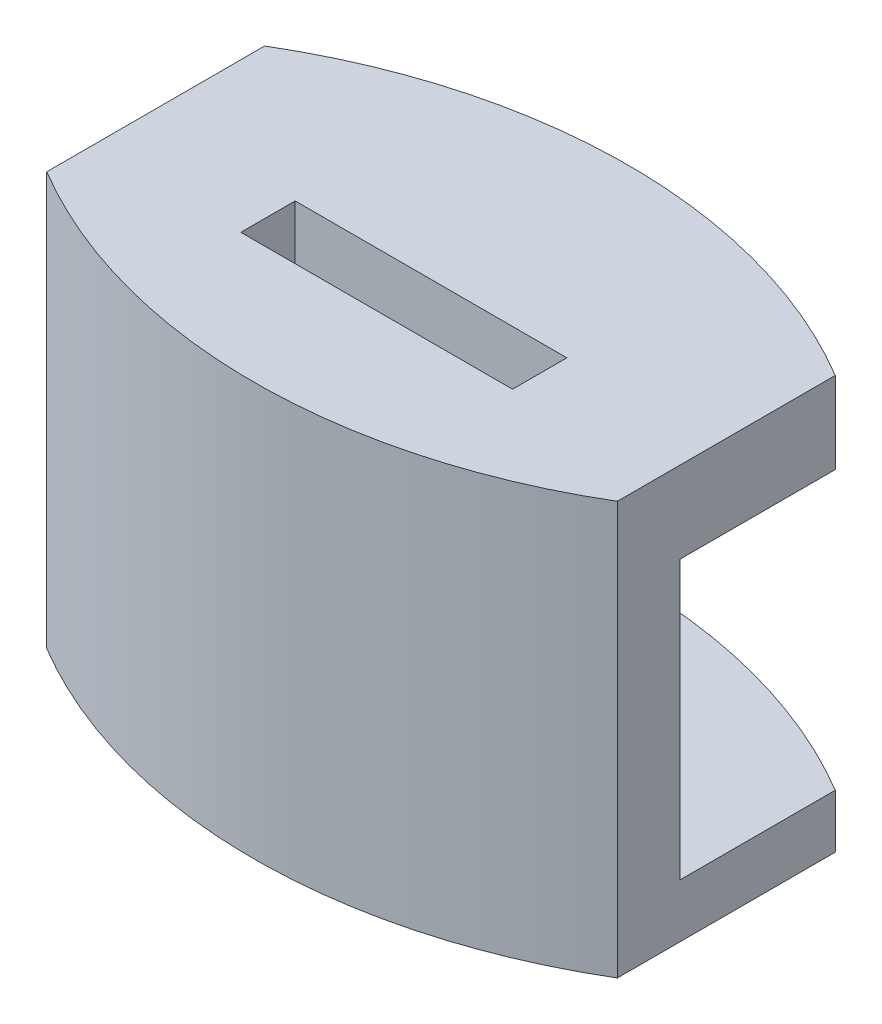
ISO-10303-21;
HEADER;
FILE_DESCRIPTION(('STEP AP214'),'2;1');
FILE_NAME('part.step','',(''),(''),'','','');
FILE_SCHEMA(('AUTOMOTIVE_DESIGN { 1 0 10303 214 1 1 1 1 }'));
ENDSEC;
DATA;
#1=APPLICATION_CONTEXT('core data for automotive mechanical design processes');
#2=APPLICATION_PROTOCOL_DEFINITION('international standard','automotive_design',2000,#1);
#3=PRODUCT_CONTEXT('',#1,'mechanical');
#4=PRODUCT('Part','Part','',(#3));
#5=PRODUCT_RELATED_PRODUCT_CATEGORY('part','',(#4));
#6=PRODUCT_DEFINITION_FORMATION('','',#4);
#7=PRODUCT_DEFINITION_CONTEXT('part definition',#1,'design');
#8=PRODUCT_DEFINITION('design','',#6,#7);
#9=PRODUCT_DEFINITION_SHAPE('','',#8);
#10=(LENGTH_UNIT() NAMED_UNIT(*) SI_UNIT(.MILLI.,.METRE.));
#11=(NAMED_UNIT(*) PLANE_ANGLE_UNIT() SI_UNIT($,.RADIAN.));
#12=(NAMED_UNIT(*) SI_UNIT($,.STERADIAN.) SOLID_ANGLE_UNIT());
#13=UNCERTAINTY_MEASURE_WITH_UNIT(LENGTH_MEASURE(1.E-05),#10,'distance_accuracy_value','');
#14=(GEOMETRIC_REPRESENTATION_CONTEXT(3) GLOBAL_UNCERTAINTY_ASSIGNED_CONTEXT((#13)) GLOBAL_UNIT_ASSIGNED_CONTEXT((#10,
#11,#12)) REPRESENTATION_CONTEXT('',''));
#15=CARTESIAN_POINT('',(0.,0.,0.));
#16=DIRECTION('',(0.,0.,1.));
#17=DIRECTION('',(1.,0.,0.));
#18=AXIS2_PLACEMENT_3D('',#15,#16,#17);
#19=CARTESIAN_POINT('',(0.,0.0119999800000849,8.99521201950843));
#20=DIRECTION('',(0.,1.,0.));
#21=DIRECTION('',(0.,0.,1.));
#22=AXIS2_PLACEMENT_3D('',#19,#20,#21);
#23=CYLINDRICAL_SURFACE('',#22,20.5);
#24=CARTESIAN_POINT('',(0.,2.,8.99521201950843));
#25=DIRECTION('',(0.,-1.,0.));
#26=DIRECTION('',(0.,0.,-1.));
#27=AXIS2_PLACEMENT_3D('',#24,#25,#26);
#28=CIRCLE('',#27,20.5);
#29=CARTESIAN_POINT('',(10.5,2.,-8.61160484215057));
#30=VERTEX_POINT('',#29);
#31=CARTESIAN_POINT('',(-10.5,2.,-8.61160484215058));
#32=VERTEX_POINT('',#31);
#33=EDGE_CURVE('E131',#30,#32,#28,.F.);
#34=ORIENTED_EDGE('',*,*,#33,.F.);
#35=DIRECTION('',(0.,-1.,0.));
#36=VECTOR('',#35,1.);
#37=CARTESIAN_POINT('',(10.5,38.576,-8.61160484215057));
#38=LINE('',#37,#36);
#39=CARTESIAN_POINT('',(10.5,0.0254,-8.61160484215057));
#40=VERTEX_POINT('',#39);
#41=EDGE_CURVE('E171',#30,#40,#38,.T.);
#42=ORIENTED_EDGE('',*,*,#41,.T.);
#43=CARTESIAN_POINT('',(0.,0.0254,8.99521201950843));
#44=DIRECTION('',(0.,1.,0.));
#45=DIRECTION('',(0.,0.,1.));
#46=AXIS2_PLACEMENT_3D('',#43,#44,#45);
#47=CIRCLE('',#46,20.5);
#48=CARTESIAN_POINT('',(-10.5,0.0254,-8.61160484215058));
#49=VERTEX_POINT('',#48);
#50=EDGE_CURVE('E11',#49,#40,#47,.F.);
#51=ORIENTED_EDGE('',*,*,#50,.F.);
#52=DIRECTION('',(0.,1.,0.));
#53=VECTOR('',#52,1.);
#54=CARTESIAN_POINT('',(-10.5,0.0119999800000849,-8.61160484215058));
#55=LINE('',#54,#53);
#56=EDGE_CURVE('E186',#49,#32,#55,.T.);
#57=ORIENTED_EDGE('',*,*,#56,.T.);
#58=EDGE_LOOP('',(#34,#42,#51,#57));
#59=FACE_BOUND('',#58,.T.);
#60=ADVANCED_FACE('F33',(#59),#23,.T.);
#61=CARTESIAN_POINT('',(0.,15.21999998,-20.5));
#62=DIRECTION('',(0.,1.,0.));
#63=DIRECTION('',(0.,0.,1.));
#64=AXIS2_PLACEMENT_3D('',#61,#62,#63);
#65=PLANE('',#64);
#66=DIRECTION('',(0.,0.,-1.));
#67=VECTOR('',#66,1.);
#68=CARTESIAN_POINT('',(4.99999999999999,15.21999998,-20.5));
#69=LINE('',#68,#67);
#70=CARTESIAN_POINT('',(5.,15.21999998,-2.2352));
#71=VERTEX_POINT('',#70);
#72=CARTESIAN_POINT('',(5.,15.21999998,-4.2352));
#73=VERTEX_POINT('',#72);
#74=EDGE_CURVE('E197',#71,#73,#69,.T.);
#75=ORIENTED_EDGE('',*,*,#74,.F.);
#76=DIRECTION('',(1.,0.,0.));
#77=VECTOR('',#76,1.);
#78=CARTESIAN_POINT('',(0.,15.21999998,-2.2352));
#79=LINE('',#78,#77);
#80=CARTESIAN_POINT('',(-5.,15.21999998,-2.2352));
#81=VERTEX_POINT('',#80);
#82=EDGE_CURVE('E204',#81,#71,#79,.T.);
#83=ORIENTED_EDGE('',*,*,#82,.F.);
#84=DIRECTION('',(0.,0.,1.));
#85=VECTOR('',#84,1.);
#86=CARTESIAN_POINT('',(-4.99999999999999,15.21999998,-20.5));
#87=LINE('',#86,#85);
#88=CARTESIAN_POINT('',(-5.,15.21999998,-4.2352));
#89=VERTEX_POINT('',#88);
#90=EDGE_CURVE('E202',#89,#81,#87,.T.);
#91=ORIENTED_EDGE('',*,*,#90,.F.);
#92=DIRECTION('',(-1.,0.,0.));
#93=VECTOR('',#92,1.);
#94=CARTESIAN_POINT('',(0.,15.21999998,-4.2352));
#95=LINE('',#94,#93);
#96=EDGE_CURVE('E198',#73,#89,#95,.T.);
#97=ORIENTED_EDGE('',*,*,#96,.F.);
#98=EDGE_LOOP('',(#75,#83,#91,#97));
#99=FACE_BOUND('',#98,.T.);
#100=CARTESIAN_POINT('',(0.,15.21999998,-18.199999842));
#101=DIRECTION('',(0.,1.,0.));
#102=DIRECTION('',(0.,0.,1.));
#103=AXIS2_PLACEMENT_3D('',#100,#101,#102);
#104=CIRCLE('',#103,20.5);
#105=CARTESIAN_POINT('',(10.5,15.21999998,-0.593182980340997));
#106=VERTEX_POINT('',#105);
#107=CARTESIAN_POINT('',(-10.5,15.21999998,-0.593182980340994));
#108=VERTEX_POINT('',#107);
#109=EDGE_CURVE('E179',#106,#108,#104,.F.);
#110=ORIENTED_EDGE('',*,*,#109,.F.);
#111=DIRECTION('',(0.,0.,-1.));
#112=VECTOR('',#111,1.);
#113=CARTESIAN_POINT('',(10.5,15.21999998,-20.5));
#114=LINE('',#113,#112);
#115=CARTESIAN_POINT('',(10.5,15.21999998,-8.61160484215057));
#116=VERTEX_POINT('',#115);
#117=EDGE_CURVE('E164',#106,#116,#114,.T.);
#118=ORIENTED_EDGE('',*,*,#117,.T.);
#119=CARTESIAN_POINT('',(0.,15.21999998,8.99521201950843));
#120=DIRECTION('',(0.,1.,0.));
#121=DIRECTION('',(0.,0.,-1.));
#122=AXIS2_PLACEMENT_3D('',#119,#120,#121);
#123=CIRCLE('',#122,20.5);
#124=CARTESIAN_POINT('',(-10.5,15.21999998,-8.61160484215058));
#125=VERTEX_POINT('',#124);
#126=EDGE_CURVE('E225',#116,#125,#123,.T.);
#127=ORIENTED_EDGE('',*,*,#126,.T.);
#128=DIRECTION('',(0.,0.,1.));
#129=VECTOR('',#128,1.);
#130=CARTESIAN_POINT('',(-10.5,15.21999998,-20.5));
#131=LINE('',#130,#129);
#132=EDGE_CURVE('E140',#125,#108,#131,.T.);
#133=ORIENTED_EDGE('',*,*,#132,.T.);
#134=EDGE_LOOP('',(#110,#118,#127,#133));
#135=FACE_BOUND('',#134,.T.);
#136=ADVANCED_FACE('F185',(#99,#135),#65,.T.);
#137=CARTESIAN_POINT('',(0.,15.21999998,-20.5));
#138=DIRECTION('',(0.,-1.,0.));
#139=DIRECTION('',(0.,0.,-1.));
#140=AXIS2_PLACEMENT_3D('',#137,#138,#139);
#141=CYLINDRICAL_SURFACE('',#140,20.5);
#142=DIRECTION('',(0.,-1.,0.));
#143=VECTOR('',#142,1.);
#144=CARTESIAN_POINT('',(10.5,15.21999998,-2.893183138341));
#145=LINE('',#144,#143);
#146=CARTESIAN_POINT('',(10.5,2.,-2.893183138341));
#147=VERTEX_POINT('',#146);
#148=CARTESIAN_POINT('',(10.5,12.21999998,-2.893183138341));
#149=VERTEX_POINT('',#148);
#150=EDGE_CURVE('E159',#147,#149,#145,.F.);
#151=ORIENTED_EDGE('',*,*,#150,.F.);
#152=CARTESIAN_POINT('',(0.,2.,-20.5));
#153=DIRECTION('',(0.,1.,0.));
#154=DIRECTION('',(0.,0.,1.));
#155=AXIS2_PLACEMENT_3D('',#152,#153,#154);
#156=CIRCLE('',#155,20.5);
#157=CARTESIAN_POINT('',(-10.5,2.,-2.89318313834099));
#158=VERTEX_POINT('',#157);
#159=EDGE_CURVE('E167',#147,#158,#156,.F.);
#160=ORIENTED_EDGE('',*,*,#159,.T.);
#161=DIRECTION('',(0.,-1.,0.));
#162=VECTOR('',#161,1.);
#163=CARTESIAN_POINT('',(-10.5,15.21999998,-2.89318313834099));
#164=LINE('',#163,#162);
#165=CARTESIAN_POINT('',(-10.5,12.21999998,-2.89318313834099));
#166=VERTEX_POINT('',#165);
#167=EDGE_CURVE('E149',#166,#158,#164,.T.);
#168=ORIENTED_EDGE('',*,*,#167,.F.);
#169=CARTESIAN_POINT('',(0.,12.21999998,-20.5));
#170=DIRECTION('',(0.,-1.,0.));
#171=DIRECTION('',(0.,0.,-1.));
#172=AXIS2_PLACEMENT_3D('',#169,#170,#171);
#173=CIRCLE('',#172,20.5);
#174=EDGE_CURVE('E148',#166,#149,#173,.F.);
#175=ORIENTED_EDGE('',*,*,#174,.T.);
#176=EDGE_LOOP('',(#151,#160,#168,#175));
#177=FACE_BOUND('',#176,.T.);
#178=ADVANCED_FACE('F35',(#177),#141,.F.);
#179=CARTESIAN_POINT('',(0.,12.21999998,0.));
#180=DIRECTION('',(0.,-1.,0.));
#181=DIRECTION('',(0.,0.,-1.));
#182=AXIS2_PLACEMENT_3D('',#179,#180,#181);
#183=PLANE('',#182);
#184=DIRECTION('',(0.,0.,-1.));
#185=VECTOR('',#184,1.);
#186=CARTESIAN_POINT('',(-10.5,12.21999998,0.));
#187=LINE('',#186,#185);
#188=CARTESIAN_POINT('',(-10.5,12.21999998,-8.61160484215057));
#189=VERTEX_POINT('',#188);
#190=EDGE_CURVE('E136',#166,#189,#187,.T.);
#191=ORIENTED_EDGE('',*,*,#190,.T.);
#192=CARTESIAN_POINT('',(0.,12.21999998,8.99521201950843));
#193=DIRECTION('',(0.,1.,0.));
#194=DIRECTION('',(0.,0.,1.));
#195=AXIS2_PLACEMENT_3D('',#192,#193,#194);
#196=CIRCLE('',#195,20.5);
#197=CARTESIAN_POINT('',(10.5,12.21999998,-8.61160484215057));
#198=VERTEX_POINT('',#197);
#199=EDGE_CURVE('E121',#189,#198,#196,.F.);
#200=ORIENTED_EDGE('',*,*,#199,.T.);
#201=DIRECTION('',(0.,0.,1.));
#202=VECTOR('',#201,1.);
#203=CARTESIAN_POINT('',(10.5,12.21999998,0.));
#204=LINE('',#203,#202);
#205=EDGE_CURVE('E162',#198,#149,#204,.T.);
#206=ORIENTED_EDGE('',*,*,#205,.T.);
#207=ORIENTED_EDGE('',*,*,#174,.F.);
#208=EDGE_LOOP('',(#191,#200,#206,#207));
#209=FACE_BOUND('',#208,.T.);
#210=DIRECTION('',(0.,0.,1.));
#211=VECTOR('',#210,1.);
#212=CARTESIAN_POINT('',(5.,12.21999998,-2.2352));
#213=LINE('',#212,#211);
#214=CARTESIAN_POINT('',(5.,12.21999998,-4.2352));
#215=VERTEX_POINT('',#214);
#216=CARTESIAN_POINT('',(5.,12.21999998,-2.2352));
#217=VERTEX_POINT('',#216);
#218=EDGE_CURVE('E141',#215,#217,#213,.T.);
#219=ORIENTED_EDGE('',*,*,#218,.F.);
#220=DIRECTION('',(1.,0.,0.));
#221=VECTOR('',#220,1.);
#222=CARTESIAN_POINT('',(-5.,12.21999998,-4.2352));
#223=LINE('',#222,#221);
#224=CARTESIAN_POINT('',(-5.,12.21999998,-4.2352));
#225=VERTEX_POINT('',#224);
#226=EDGE_CURVE('E210',#225,#215,#223,.T.);
#227=ORIENTED_EDGE('',*,*,#226,.F.);
#228=DIRECTION('',(0.,0.,-1.));
#229=VECTOR('',#228,1.);
#230=CARTESIAN_POINT('',(-5.,12.21999998,-2.2352));
#231=LINE('',#230,#229);
#232=CARTESIAN_POINT('',(-5.,12.21999998,-2.2352));
#233=VERTEX_POINT('',#232);
#234=EDGE_CURVE('E217',#233,#225,#231,.T.);
#235=ORIENTED_EDGE('',*,*,#234,.F.);
#236=DIRECTION('',(-1.,0.,0.));
#237=VECTOR('',#236,1.);
#238=CARTESIAN_POINT('',(-5.,12.21999998,-2.2352));
#239=LINE('',#238,#237);
#240=EDGE_CURVE('E220',#217,#233,#239,.T.);
#241=ORIENTED_EDGE('',*,*,#240,.F.);
#242=EDGE_LOOP('',(#219,#227,#235,#241));
#243=FACE_BOUND('',#242,.T.);
#244=ADVANCED_FACE('F145',(#209,#243),#183,.T.);
#245=CARTESIAN_POINT('',(0.,2.,0.));
#246=DIRECTION('',(0.,1.,0.));
#247=DIRECTION('',(0.,0.,1.));
#248=AXIS2_PLACEMENT_3D('',#245,#246,#247);
#249=PLANE('',#248);
#250=DIRECTION('',(0.,0.,-1.));
#251=VECTOR('',#250,1.);
#252=CARTESIAN_POINT('',(10.5,2.,0.));
#253=LINE('',#252,#251);
#254=EDGE_CURVE('E151',#147,#30,#253,.T.);
#255=ORIENTED_EDGE('',*,*,#254,.T.);
#256=ORIENTED_EDGE('',*,*,#33,.T.);
#257=DIRECTION('',(0.,0.,1.));
#258=VECTOR('',#257,1.);
#259=CARTESIAN_POINT('',(-10.5,2.,0.));
#260=LINE('',#259,#258);
#261=EDGE_CURVE('E153',#32,#158,#260,.T.);
#262=ORIENTED_EDGE('',*,*,#261,.T.);
#263=ORIENTED_EDGE('',*,*,#159,.F.);
#264=EDGE_LOOP('',(#255,#256,#262,#263));
#265=FACE_BOUND('',#264,.T.);
#266=ADVANCED_FACE('F231',(#265),#249,.T.);
#267=CARTESIAN_POINT('',(-10.5,38.576,52.2585437792315));
#268=DIRECTION('',(-1.,0.,0.));
#269=DIRECTION('',(0.,0.,1.));
#270=AXIS2_PLACEMENT_3D('',#267,#268,#269);
#271=PLANE('',#270);
#272=DIRECTION('',(0.,0.,-1.));
#273=VECTOR('',#272,1.);
#274=CARTESIAN_POINT('',(-10.5,0.0254000000000018,52.2585437792315));
#275=LINE('',#274,#273);
#276=CARTESIAN_POINT('',(-10.5,0.0254000000000018,-0.59318298034098));
#277=VERTEX_POINT('',#276);
#278=EDGE_CURVE('E47',#277,#49,#275,.T.);
#279=ORIENTED_EDGE('',*,*,#278,.F.);
#280=DIRECTION('',(0.,-1.,0.));
#281=VECTOR('',#280,1.);
#282=CARTESIAN_POINT('',(-10.5,29.69799998,-0.593182980340994));
#283=LINE('',#282,#281);
#284=EDGE_CURVE('E142',#108,#277,#283,.T.);
#285=ORIENTED_EDGE('',*,*,#284,.F.);
#286=ORIENTED_EDGE('',*,*,#132,.F.);
#287=DIRECTION('',(0.,1.,0.));
#288=VECTOR('',#287,1.);
#289=CARTESIAN_POINT('',(-10.5,38.576,-8.61160484215057));
#290=LINE('',#289,#288);
#291=EDGE_CURVE('E125',#189,#125,#290,.T.);
#292=ORIENTED_EDGE('',*,*,#291,.F.);
#293=ORIENTED_EDGE('',*,*,#190,.F.);
#294=ORIENTED_EDGE('',*,*,#167,.T.);
#295=ORIENTED_EDGE('',*,*,#261,.F.);
#296=ORIENTED_EDGE('',*,*,#56,.F.);
#297=EDGE_LOOP('',(#279,#285,#286,#292,#293,#294,#295,#296));
#298=FACE_BOUND('',#297,.T.);
#299=ADVANCED_FACE('F134',(#298),#271,.T.);
#300=CARTESIAN_POINT('',(10.5,38.576,52.2585437792315));
#301=DIRECTION('',(1.,0.,0.));
#302=DIRECTION('',(0.,0.,-1.));
#303=AXIS2_PLACEMENT_3D('',#300,#301,#302);
#304=PLANE('',#303);
#305=DIRECTION('',(0.,0.,1.));
#306=VECTOR('',#305,1.);
#307=CARTESIAN_POINT('',(10.5,0.0254000000000018,52.2585437792315));
#308=LINE('',#307,#306);
#309=CARTESIAN_POINT('',(10.5,0.0254000000000018,-0.59318298034098));
#310=VERTEX_POINT('',#309);
#311=EDGE_CURVE('E229',#40,#310,#308,.T.);
#312=ORIENTED_EDGE('',*,*,#311,.F.);
#313=ORIENTED_EDGE('',*,*,#41,.F.);
#314=ORIENTED_EDGE('',*,*,#254,.F.);
#315=ORIENTED_EDGE('',*,*,#150,.T.);
#316=ORIENTED_EDGE('',*,*,#205,.F.);
#317=EDGE_CURVE('E127',#116,#198,#38,.T.);
#318=ORIENTED_EDGE('',*,*,#317,.F.);
#319=ORIENTED_EDGE('',*,*,#117,.F.);
#320=DIRECTION('',(0.,-1.,0.));
#321=VECTOR('',#320,1.);
#322=CARTESIAN_POINT('',(10.5,29.69799998,-0.593182980340997));
#323=LINE('',#322,#321);
#324=EDGE_CURVE('E41',#310,#106,#323,.F.);
#325=ORIENTED_EDGE('',*,*,#324,.F.);
#326=EDGE_LOOP('',(#312,#313,#314,#315,#316,#318,#319,#325));
#327=FACE_BOUND('',#326,.T.);
#328=ADVANCED_FACE('F188',(#327),#304,.T.);
#329=CARTESIAN_POINT('',(5.,50.79599998,-2.2352));
#330=DIRECTION('',(1.,0.,0.));
#331=DIRECTION('',(0.,0.,-1.));
#332=AXIS2_PLACEMENT_3D('',#329,#330,#331);
#333=PLANE('',#332);
#334=ORIENTED_EDGE('',*,*,#74,.T.);
#335=DIRECTION('',(0.,-1.,0.));
#336=VECTOR('',#335,1.);
#337=CARTESIAN_POINT('',(5.,50.79599998,-4.2352));
#338=LINE('',#337,#336);
#339=EDGE_CURVE('E206',#73,#215,#338,.T.);
#340=ORIENTED_EDGE('',*,*,#339,.T.);
#341=ORIENTED_EDGE('',*,*,#218,.T.);
#342=DIRECTION('',(0.,-1.,0.));
#343=VECTOR('',#342,1.);
#344=CARTESIAN_POINT('',(5.,50.79599998,-2.2352));
#345=LINE('',#344,#343);
#346=EDGE_CURVE('E207',#71,#217,#345,.T.);
#347=ORIENTED_EDGE('',*,*,#346,.F.);
#348=EDGE_LOOP('',(#334,#340,#341,#347));
#349=FACE_BOUND('',#348,.T.);
#350=ADVANCED_FACE('F253',(#349),#333,.F.);
#351=CARTESIAN_POINT('',(-5.,50.79599998,-4.2352));
#352=DIRECTION('',(0.,0.,-1.));
#353=DIRECTION('',(-1.,0.,0.));
#354=AXIS2_PLACEMENT_3D('',#351,#352,#353);
#355=PLANE('',#354);
#356=ORIENTED_EDGE('',*,*,#96,.T.);
#357=DIRECTION('',(0.,-1.,0.));
#358=VECTOR('',#357,1.);
#359=CARTESIAN_POINT('',(-5.,50.79599998,-4.2352));
#360=LINE('',#359,#358);
#361=EDGE_CURVE('E212',#89,#225,#360,.T.);
#362=ORIENTED_EDGE('',*,*,#361,.T.);
#363=ORIENTED_EDGE('',*,*,#226,.T.);
#364=ORIENTED_EDGE('',*,*,#339,.F.);
#365=EDGE_LOOP('',(#356,#362,#363,#364));
#366=FACE_BOUND('',#365,.T.);
#367=ADVANCED_FACE('F249',(#366),#355,.F.);
#368=CARTESIAN_POINT('',(-5.,50.79599998,-2.2352));
#369=DIRECTION('',(-1.,0.,0.));
#370=DIRECTION('',(0.,0.,1.));
#371=AXIS2_PLACEMENT_3D('',#368,#369,#370);
#372=PLANE('',#371);
#373=ORIENTED_EDGE('',*,*,#90,.T.);
#374=DIRECTION('',(0.,-1.,0.));
#375=VECTOR('',#374,1.);
#376=CARTESIAN_POINT('',(-5.,50.79599998,-2.2352));
#377=LINE('',#376,#375);
#378=EDGE_CURVE('E55',#81,#233,#377,.T.);
#379=ORIENTED_EDGE('',*,*,#378,.T.);
#380=ORIENTED_EDGE('',*,*,#234,.T.);
#381=ORIENTED_EDGE('',*,*,#361,.F.);
#382=EDGE_LOOP('',(#373,#379,#380,#381));
#383=FACE_BOUND('',#382,.T.);
#384=ADVANCED_FACE('F252',(#383),#372,.F.);
#385=CARTESIAN_POINT('',(-5.,50.79599998,-2.2352));
#386=DIRECTION('',(0.,0.,1.));
#387=DIRECTION('',(1.,0.,0.));
#388=AXIS2_PLACEMENT_3D('',#385,#386,#387);
#389=PLANE('',#388);
#390=ORIENTED_EDGE('',*,*,#82,.T.);
#391=ORIENTED_EDGE('',*,*,#346,.T.);
#392=ORIENTED_EDGE('',*,*,#240,.T.);
#393=ORIENTED_EDGE('',*,*,#378,.F.);
#394=EDGE_LOOP('',(#390,#391,#392,#393));
#395=FACE_BOUND('',#394,.T.);
#396=ADVANCED_FACE('F248',(#395),#389,.F.);
#397=CARTESIAN_POINT('',(0.,29.69799998,-18.199999842));
#398=DIRECTION('',(0.,-1.,0.));
#399=DIRECTION('',(0.,0.,-1.));
#400=AXIS2_PLACEMENT_3D('',#397,#398,#399);
#401=CYLINDRICAL_SURFACE('',#400,20.5);
#402=ORIENTED_EDGE('',*,*,#284,.T.);
#403=CARTESIAN_POINT('',(0.,0.0253999999999983,-18.199999842));
#404=DIRECTION('',(0.,1.,0.));
#405=DIRECTION('',(0.,0.,1.));
#406=AXIS2_PLACEMENT_3D('',#403,#404,#405);
#407=CIRCLE('',#406,20.5);
#408=EDGE_CURVE('E180',#277,#310,#407,.T.);
#409=ORIENTED_EDGE('',*,*,#408,.T.);
#410=ORIENTED_EDGE('',*,*,#324,.T.);
#411=ORIENTED_EDGE('',*,*,#109,.T.);
#412=EDGE_LOOP('',(#402,#409,#410,#411));
#413=FACE_BOUND('',#412,.T.);
#414=ADVANCED_FACE('F178',(#413),#401,.T.);
#415=ORIENTED_EDGE('',*,*,#199,.F.);
#416=ORIENTED_EDGE('',*,*,#291,.T.);
#417=ORIENTED_EDGE('',*,*,#126,.F.);
#418=ORIENTED_EDGE('',*,*,#317,.T.);
#419=EDGE_LOOP('',(#415,#416,#417,#418));
#420=FACE_BOUND('',#419,.T.);
#421=ADVANCED_FACE('F123',(#420),#23,.T.);
#422=CARTESIAN_POINT('',(0.,0.0254,0.));
#423=DIRECTION('',(0.,1.,0.));
#424=DIRECTION('',(0.,0.,1.));
#425=AXIS2_PLACEMENT_3D('',#422,#423,#424);
#426=PLANE('',#425);
#427=ORIENTED_EDGE('',*,*,#278,.T.);
#428=ORIENTED_EDGE('',*,*,#50,.T.);
#429=ORIENTED_EDGE('',*,*,#311,.T.);
#430=ORIENTED_EDGE('',*,*,#408,.F.);
#431=EDGE_LOOP('',(#427,#428,#429,#430));
#432=FACE_BOUND('',#431,.T.);
#433=ADVANCED_FACE('F233',(#432),#426,.F.);
#434=CLOSED_SHELL('',(#60,#136,#178,#244,#266,#299,#328,#350,#367,#384,#396,#414,#421,#433));
#435=MANIFOLD_SOLID_BREP('B2',#434);
#436=ADVANCED_BREP_SHAPE_REPRESENTATION('',(#18,#435),#14);
#437=SHAPE_DEFINITION_REPRESENTATION(#9,#436);
ENDSEC;
END-ISO-10303-21;
